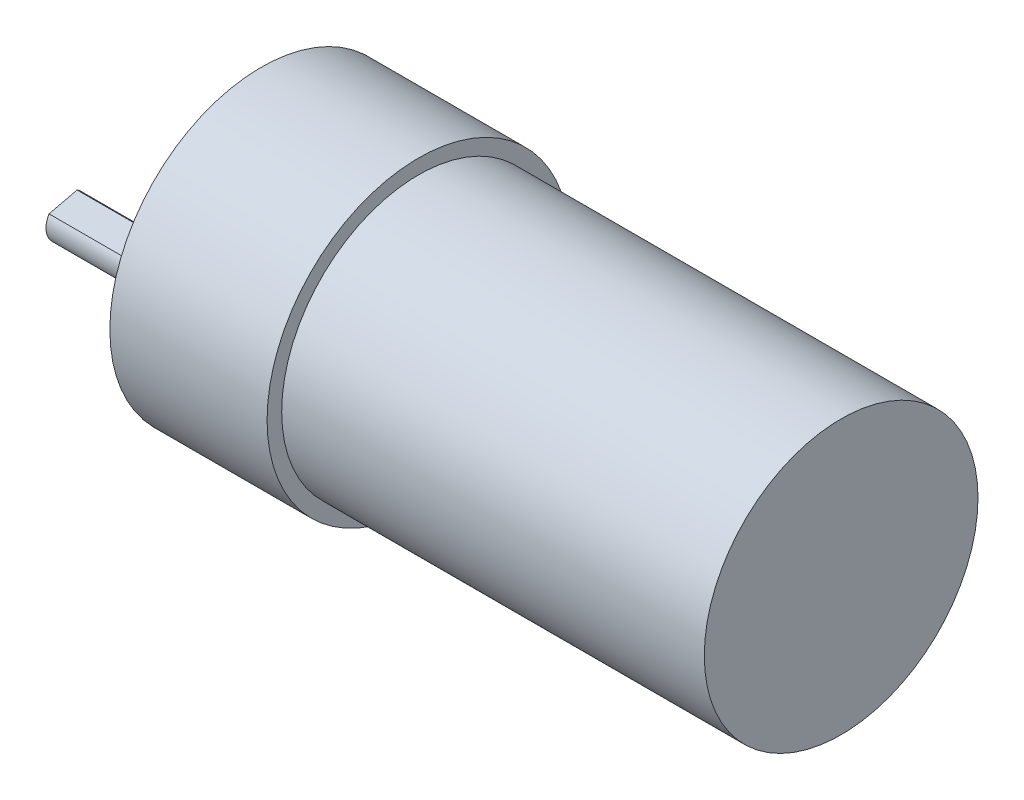
ISO-10303-21;
HEADER;
FILE_DESCRIPTION(('STEP AP214'),'2;1');
FILE_NAME('part.step','',(''),(''),'','','');
FILE_SCHEMA(('AUTOMOTIVE_DESIGN { 1 0 10303 214 1 1 1 1 }'));
ENDSEC;
DATA;
#1=APPLICATION_CONTEXT('core data for automotive mechanical design processes');
#2=APPLICATION_PROTOCOL_DEFINITION('international standard','automotive_design',2000,#1);
#3=PRODUCT_CONTEXT('',#1,'mechanical');
#4=PRODUCT('Part','Part','',(#3));
#5=PRODUCT_RELATED_PRODUCT_CATEGORY('part','',(#4));
#6=PRODUCT_DEFINITION_FORMATION('','',#4);
#7=PRODUCT_DEFINITION_CONTEXT('part definition',#1,'design');
#8=PRODUCT_DEFINITION('design','',#6,#7);
#9=PRODUCT_DEFINITION_SHAPE('','',#8);
#10=(LENGTH_UNIT() NAMED_UNIT(*) SI_UNIT(.MILLI.,.METRE.));
#11=(NAMED_UNIT(*) PLANE_ANGLE_UNIT() SI_UNIT($,.RADIAN.));
#12=(NAMED_UNIT(*) SI_UNIT($,.STERADIAN.) SOLID_ANGLE_UNIT());
#13=UNCERTAINTY_MEASURE_WITH_UNIT(LENGTH_MEASURE(1.E-05),#10,'distance_accuracy_value','');
#14=(GEOMETRIC_REPRESENTATION_CONTEXT(3) GLOBAL_UNCERTAINTY_ASSIGNED_CONTEXT((#13)) GLOBAL_UNIT_ASSIGNED_CONTEXT((#10,
#11,#12)) REPRESENTATION_CONTEXT('',''));
#15=CARTESIAN_POINT('',(0.,0.,0.));
#16=DIRECTION('',(0.,0.,1.));
#17=DIRECTION('',(1.,0.,0.));
#18=AXIS2_PLACEMENT_3D('',#15,#16,#17);
#19=CARTESIAN_POINT('',(-40.8432,-8.71855,0.));
#20=DIRECTION('',(1.,0.,0.));
#21=DIRECTION('',(0.,0.,-1.));
#22=AXIS2_PLACEMENT_3D('',#19,#20,#21);
#23=CYLINDRICAL_SURFACE('',#22,2.3749);
#24=CARTESIAN_POINT('',(-18.2372,-8.71855,0.));
#25=DIRECTION('',(-1.,0.,0.));
#26=DIRECTION('',(0.,0.,1.));
#27=AXIS2_PLACEMENT_3D('',#24,#25,#26);
#28=CIRCLE('',#27,2.3749);
#29=CARTESIAN_POINT('',(-18.2372,-8.71855,2.3749));
#30=VERTEX_POINT('',#29);
#31=EDGE_CURVE('E90',#30,#30,#28,.T.);
#32=ORIENTED_EDGE('',*,*,#31,.T.);
#33=EDGE_LOOP('',(#32));
#34=FACE_BOUND('',#33,.T.);
#35=DIRECTION('',(1.,0.,0.));
#36=VECTOR('',#35,1.);
#37=CARTESIAN_POINT('',(-40.8432,-6.68747817064265,-1.23081161596361));
#38=LINE('',#37,#36);
#39=CARTESIAN_POINT('',(-25.8572,-6.68747817064265,-1.23081161596361));
#40=VERTEX_POINT('',#39);
#41=CARTESIAN_POINT('',(-40.8432,-6.68747817064265,-1.23081161596361));
#42=VERTEX_POINT('',#41);
#43=EDGE_CURVE('E51',#40,#42,#38,.F.);
#44=ORIENTED_EDGE('',*,*,#43,.F.);
#45=CARTESIAN_POINT('',(-25.8572,-8.71855,0.));
#46=DIRECTION('',(1.,0.,0.));
#47=DIRECTION('',(0.,0.,-1.));
#48=AXIS2_PLACEMENT_3D('',#45,#46,#47);
#49=CIRCLE('',#48,2.3749);
#50=CARTESIAN_POINT('',(-25.8572,-7.46406700754952,2.01653723785416));
#51=VERTEX_POINT('',#50);
#52=EDGE_CURVE('E11',#40,#51,#49,.T.);
#53=ORIENTED_EDGE('',*,*,#52,.T.);
#54=DIRECTION('',(1.,0.,0.));
#55=VECTOR('',#54,1.);
#56=CARTESIAN_POINT('',(-40.8432,-7.46406700754952,2.01653723785416));
#57=LINE('',#56,#55);
#58=CARTESIAN_POINT('',(-40.8432,-7.46406700754952,2.01653723785416));
#59=VERTEX_POINT('',#58);
#60=EDGE_CURVE('E60',#59,#51,#57,.T.);
#61=ORIENTED_EDGE('',*,*,#60,.F.);
#62=CARTESIAN_POINT('',(-40.8432,-8.71855,0.));
#63=DIRECTION('',(-1.,0.,0.));
#64=DIRECTION('',(0.,0.,1.));
#65=AXIS2_PLACEMENT_3D('',#62,#63,#64);
#66=CIRCLE('',#65,2.3749);
#67=EDGE_CURVE('E72',#42,#59,#66,.T.);
#68=ORIENTED_EDGE('',*,*,#67,.F.);
#69=EDGE_LOOP('',(#44,#53,#61,#68));
#70=FACE_BOUND('',#69,.T.);
#71=ADVANCED_FACE('F36',(#34,#70),#23,.T.);
#72=CARTESIAN_POINT('',(-40.8432,-8.71855,0.));
#73=DIRECTION('',(-1.,0.,0.));
#74=DIRECTION('',(0.,0.,1.));
#75=AXIS2_PLACEMENT_3D('',#72,#73,#74);
#76=PLANE('',#75);
#77=ORIENTED_EDGE('',*,*,#67,.T.);
#78=DIRECTION('',(0.,0.232587064676617,-0.972575579245703));
#79=VECTOR('',#78,1.);
#80=CARTESIAN_POINT('',(-40.8432,-7.07577258909608,0.392862810945275));
#81=LINE('',#80,#79);
#82=EDGE_CURVE('E44',#59,#42,#81,.T.);
#83=ORIENTED_EDGE('',*,*,#82,.T.);
#84=EDGE_LOOP('',(#77,#83));
#85=FACE_BOUND('',#84,.T.);
#86=ADVANCED_FACE('F108',(#85),#76,.T.);
#87=CARTESIAN_POINT('',(-18.2372,0.,0.));
#88=DIRECTION('',(-1.,0.,0.));
#89=DIRECTION('',(0.,0.,1.));
#90=AXIS2_PLACEMENT_3D('',#87,#88,#89);
#91=PLANE('',#90);
#92=CARTESIAN_POINT('',(-18.2372,-8.71855,-10.2108));
#93=DIRECTION('',(-1.,0.,0.));
#94=DIRECTION('',(0.,0.,1.));
#95=AXIS2_PLACEMENT_3D('',#92,#93,#94);
#96=CIRCLE('',#95,1.27);
#97=CARTESIAN_POINT('',(-18.2372,-8.71855,-8.9408));
#98=VERTEX_POINT('',#97);
#99=EDGE_CURVE('E67',#98,#98,#96,.T.);
#100=ORIENTED_EDGE('',*,*,#99,.F.);
#101=EDGE_LOOP('',(#100));
#102=FACE_BOUND('',#101,.T.);
#103=CARTESIAN_POINT('',(-18.2372,-8.71855,10.2108));
#104=DIRECTION('',(-1.,0.,0.));
#105=DIRECTION('',(0.,0.,1.));
#106=AXIS2_PLACEMENT_3D('',#103,#104,#105);
#107=CIRCLE('',#106,1.27);
#108=CARTESIAN_POINT('',(-18.2372,-8.71855,11.4808));
#109=VERTEX_POINT('',#108);
#110=EDGE_CURVE('E78',#109,#109,#107,.T.);
#111=ORIENTED_EDGE('',*,*,#110,.F.);
#112=EDGE_LOOP('',(#111));
#113=FACE_BOUND('',#112,.T.);
#114=CARTESIAN_POINT('',(-18.2372,13.45565,0.));
#115=DIRECTION('',(-1.,0.,0.));
#116=DIRECTION('',(0.,0.,1.));
#117=AXIS2_PLACEMENT_3D('',#114,#115,#116);
#118=CIRCLE('',#117,1.27);
#119=CARTESIAN_POINT('',(-18.2372,13.45565,1.27));
#120=VERTEX_POINT('',#119);
#121=EDGE_CURVE('E84',#120,#120,#118,.T.);
#122=ORIENTED_EDGE('',*,*,#121,.F.);
#123=EDGE_LOOP('',(#122));
#124=FACE_BOUND('',#123,.T.);
#125=CARTESIAN_POINT('',(-18.2372,0.,0.));
#126=DIRECTION('',(-1.,0.,0.));
#127=DIRECTION('',(0.,0.,1.));
#128=AXIS2_PLACEMENT_3D('',#125,#126,#127);
#129=CIRCLE('',#128,17.56918);
#130=CARTESIAN_POINT('',(-18.2372,0.,17.56918));
#131=VERTEX_POINT('',#130);
#132=EDGE_CURVE('E97',#131,#131,#129,.T.);
#133=ORIENTED_EDGE('',*,*,#132,.T.);
#134=EDGE_LOOP('',(#133));
#135=FACE_BOUND('',#134,.T.);
#136=ORIENTED_EDGE('',*,*,#31,.F.);
#137=EDGE_LOOP('',(#136));
#138=FACE_BOUND('',#137,.T.);
#139=ADVANCED_FACE('F110',(#102,#113,#124,#135,#138),#91,.T.);
#140=CARTESIAN_POINT('',(49.022,0.,0.));
#141=DIRECTION('',(-1.,0.,0.));
#142=DIRECTION('',(0.,0.,1.));
#143=AXIS2_PLACEMENT_3D('',#140,#141,#142);
#144=CYLINDRICAL_SURFACE('',#143,15.875);
#145=CARTESIAN_POINT('',(49.022,0.,0.));
#146=DIRECTION('',(1.,0.,0.));
#147=DIRECTION('',(0.,0.,-1.));
#148=AXIS2_PLACEMENT_3D('',#145,#146,#147);
#149=CIRCLE('',#148,15.875);
#150=CARTESIAN_POINT('',(49.022,0.,-15.875));
#151=VERTEX_POINT('',#150);
#152=EDGE_CURVE('E105',#151,#151,#149,.T.);
#153=ORIENTED_EDGE('',*,*,#152,.F.);
#154=EDGE_LOOP('',(#153));
#155=FACE_BOUND('',#154,.T.);
#156=CARTESIAN_POINT('',(0.,0.,0.));
#157=DIRECTION('',(-1.,0.,0.));
#158=DIRECTION('',(0.,0.,1.));
#159=AXIS2_PLACEMENT_3D('',#156,#157,#158);
#160=CIRCLE('',#159,15.875);
#161=CARTESIAN_POINT('',(0.,0.,15.875));
#162=VERTEX_POINT('',#161);
#163=EDGE_CURVE('E100',#162,#162,#160,.T.);
#164=ORIENTED_EDGE('',*,*,#163,.F.);
#165=EDGE_LOOP('',(#164));
#166=FACE_BOUND('',#165,.T.);
#167=ADVANCED_FACE('F38',(#155,#166),#144,.T.);
#168=CARTESIAN_POINT('',(49.022,0.,0.));
#169=DIRECTION('',(1.,0.,0.));
#170=DIRECTION('',(0.,0.,-1.));
#171=AXIS2_PLACEMENT_3D('',#168,#169,#170);
#172=PLANE('',#171);
#173=ORIENTED_EDGE('',*,*,#152,.T.);
#174=EDGE_LOOP('',(#173));
#175=FACE_BOUND('',#174,.T.);
#176=ADVANCED_FACE('F128',(#175),#172,.T.);
#177=CARTESIAN_POINT('',(0.,0.,0.));
#178=DIRECTION('',(-1.,0.,0.));
#179=DIRECTION('',(0.,0.,1.));
#180=AXIS2_PLACEMENT_3D('',#177,#178,#179);
#181=PLANE('',#180);
#182=CARTESIAN_POINT('',(0.,0.,0.));
#183=DIRECTION('',(-1.,0.,0.));
#184=DIRECTION('',(0.,0.,1.));
#185=AXIS2_PLACEMENT_3D('',#182,#183,#184);
#186=CIRCLE('',#185,17.56918);
#187=CARTESIAN_POINT('',(0.,0.,17.56918));
#188=VERTEX_POINT('',#187);
#189=EDGE_CURVE('E94',#188,#188,#186,.T.);
#190=ORIENTED_EDGE('',*,*,#189,.F.);
#191=EDGE_LOOP('',(#190));
#192=FACE_BOUND('',#191,.T.);
#193=ORIENTED_EDGE('',*,*,#163,.T.);
#194=EDGE_LOOP('',(#193));
#195=FACE_BOUND('',#194,.T.);
#196=ADVANCED_FACE('F124',(#192,#195),#181,.F.);
#197=CARTESIAN_POINT('',(-18.2372,0.,0.));
#198=DIRECTION('',(1.,0.,0.));
#199=DIRECTION('',(0.,0.,-1.));
#200=AXIS2_PLACEMENT_3D('',#197,#198,#199);
#201=CYLINDRICAL_SURFACE('',#200,17.56918);
#202=ORIENTED_EDGE('',*,*,#132,.F.);
#203=EDGE_LOOP('',(#202));
#204=FACE_BOUND('',#203,.T.);
#205=ORIENTED_EDGE('',*,*,#189,.T.);
#206=EDGE_LOOP('',(#205));
#207=FACE_BOUND('',#206,.T.);
#208=ADVANCED_FACE('F127',(#204,#207),#201,.T.);
#209=CARTESIAN_POINT('',(-8.2372,13.45565,0.));
#210=DIRECTION('',(-1.,0.,0.));
#211=DIRECTION('',(0.,0.,1.));
#212=AXIS2_PLACEMENT_3D('',#209,#210,#211);
#213=CYLINDRICAL_SURFACE('',#212,1.27);
#214=CARTESIAN_POINT('',(-8.2372,13.45565,0.));
#215=DIRECTION('',(-1.,0.,0.));
#216=DIRECTION('',(0.,0.,1.));
#217=AXIS2_PLACEMENT_3D('',#214,#215,#216);
#218=CIRCLE('',#217,1.27);
#219=CARTESIAN_POINT('',(-8.2372,13.45565,1.27));
#220=VERTEX_POINT('',#219);
#221=EDGE_CURVE('E87',#220,#220,#218,.T.);
#222=ORIENTED_EDGE('',*,*,#221,.F.);
#223=EDGE_LOOP('',(#222));
#224=FACE_BOUND('',#223,.T.);
#225=ORIENTED_EDGE('',*,*,#121,.T.);
#226=EDGE_LOOP('',(#225));
#227=FACE_BOUND('',#226,.T.);
#228=ADVANCED_FACE('F121',(#224,#227),#213,.F.);
#229=CARTESIAN_POINT('',(-8.2372,13.45565,0.));
#230=DIRECTION('',(-1.,0.,0.));
#231=DIRECTION('',(0.,0.,1.));
#232=AXIS2_PLACEMENT_3D('',#229,#230,#231);
#233=PLANE('',#232);
#234=ORIENTED_EDGE('',*,*,#221,.T.);
#235=EDGE_LOOP('',(#234));
#236=FACE_BOUND('',#235,.T.);
#237=ADVANCED_FACE('F156',(#236),#233,.T.);
#238=CARTESIAN_POINT('',(-8.2372,-8.71855,10.2108));
#239=DIRECTION('',(-1.,0.,0.));
#240=DIRECTION('',(0.,0.,1.));
#241=AXIS2_PLACEMENT_3D('',#238,#239,#240);
#242=CYLINDRICAL_SURFACE('',#241,1.27);
#243=CARTESIAN_POINT('',(-8.2372,-8.71855,10.2108));
#244=DIRECTION('',(-1.,0.,0.));
#245=DIRECTION('',(0.,0.,1.));
#246=AXIS2_PLACEMENT_3D('',#243,#244,#245);
#247=CIRCLE('',#246,1.27);
#248=CARTESIAN_POINT('',(-8.2372,-8.71855,11.4808));
#249=VERTEX_POINT('',#248);
#250=EDGE_CURVE('E81',#249,#249,#247,.T.);
#251=ORIENTED_EDGE('',*,*,#250,.F.);
#252=EDGE_LOOP('',(#251));
#253=FACE_BOUND('',#252,.T.);
#254=ORIENTED_EDGE('',*,*,#110,.T.);
#255=EDGE_LOOP('',(#254));
#256=FACE_BOUND('',#255,.T.);
#257=ADVANCED_FACE('F161',(#253,#256),#242,.F.);
#258=CARTESIAN_POINT('',(-8.2372,-8.71855,10.2108));
#259=DIRECTION('',(-1.,0.,0.));
#260=DIRECTION('',(0.,0.,1.));
#261=AXIS2_PLACEMENT_3D('',#258,#259,#260);
#262=PLANE('',#261);
#263=ORIENTED_EDGE('',*,*,#250,.T.);
#264=EDGE_LOOP('',(#263));
#265=FACE_BOUND('',#264,.T.);
#266=ADVANCED_FACE('F166',(#265),#262,.T.);
#267=CARTESIAN_POINT('',(-8.2372,-8.71855,-10.2108));
#268=DIRECTION('',(-1.,0.,0.));
#269=DIRECTION('',(0.,0.,1.));
#270=AXIS2_PLACEMENT_3D('',#267,#268,#269);
#271=CYLINDRICAL_SURFACE('',#270,1.27);
#272=CARTESIAN_POINT('',(-8.2372,-8.71855,-10.2108));
#273=DIRECTION('',(-1.,0.,0.));
#274=DIRECTION('',(0.,0.,1.));
#275=AXIS2_PLACEMENT_3D('',#272,#273,#274);
#276=CIRCLE('',#275,1.27);
#277=CARTESIAN_POINT('',(-8.2372,-8.71855,-8.9408));
#278=VERTEX_POINT('',#277);
#279=EDGE_CURVE('E75',#278,#278,#276,.T.);
#280=ORIENTED_EDGE('',*,*,#279,.F.);
#281=EDGE_LOOP('',(#280));
#282=FACE_BOUND('',#281,.T.);
#283=ORIENTED_EDGE('',*,*,#99,.T.);
#284=EDGE_LOOP('',(#283));
#285=FACE_BOUND('',#284,.T.);
#286=ADVANCED_FACE('F176',(#282,#285),#271,.F.);
#287=CARTESIAN_POINT('',(-8.2372,-8.71855,-10.2108));
#288=DIRECTION('',(-1.,0.,0.));
#289=DIRECTION('',(0.,0.,1.));
#290=AXIS2_PLACEMENT_3D('',#287,#288,#289);
#291=PLANE('',#290);
#292=ORIENTED_EDGE('',*,*,#279,.T.);
#293=EDGE_LOOP('',(#292));
#294=FACE_BOUND('',#293,.T.);
#295=ADVANCED_FACE('F186',(#294),#291,.T.);
#296=CARTESIAN_POINT('',(-25.8572,-8.21958385216718,5.17577239912827));
#297=DIRECTION('',(1.,0.,0.));
#298=DIRECTION('',(0.,0.,-1.));
#299=AXIS2_PLACEMENT_3D('',#296,#297,#298);
#300=PLANE('',#299);
#301=DIRECTION('',(0.,0.232587064676617,-0.972575579245703));
#302=VECTOR('',#301,1.);
#303=CARTESIAN_POINT('',(-25.8572,-8.21958385216718,5.17577239912827));
#304=LINE('',#303,#302);
#305=EDGE_CURVE('E63',#51,#40,#304,.T.);
#306=ORIENTED_EDGE('',*,*,#305,.F.);
#307=ORIENTED_EDGE('',*,*,#52,.F.);
#308=EDGE_LOOP('',(#306,#307));
#309=FACE_BOUND('',#308,.T.);
#310=ADVANCED_FACE('F70',(#309),#300,.F.);
#311=CARTESIAN_POINT('',(-25.8572,-5.65789785603313,-5.5360582222337));
#312=DIRECTION('',(0.,0.972575579245703,0.232587064676617));
#313=DIRECTION('',(0.,-0.232587064676617,0.972575579245703));
#314=AXIS2_PLACEMENT_3D('',#311,#312,#313);
#315=PLANE('',#314);
#316=ORIENTED_EDGE('',*,*,#60,.T.);
#317=ORIENTED_EDGE('',*,*,#305,.T.);
#318=ORIENTED_EDGE('',*,*,#43,.T.);
#319=ORIENTED_EDGE('',*,*,#82,.F.);
#320=EDGE_LOOP('',(#316,#317,#318,#319));
#321=FACE_BOUND('',#320,.T.);
#322=ADVANCED_FACE('F62',(#321),#315,.T.);
#323=CLOSED_SHELL('',(#71,#86,#139,#167,#176,#196,#208,#228,#237,#257,#266,#286,#295,#310,#322));
#324=MANIFOLD_SOLID_BREP('B2',#323);
#325=ADVANCED_BREP_SHAPE_REPRESENTATION('',(#18,#324),#14);
#326=SHAPE_DEFINITION_REPRESENTATION(#9,#325);
ENDSEC;
END-ISO-10303-21;
